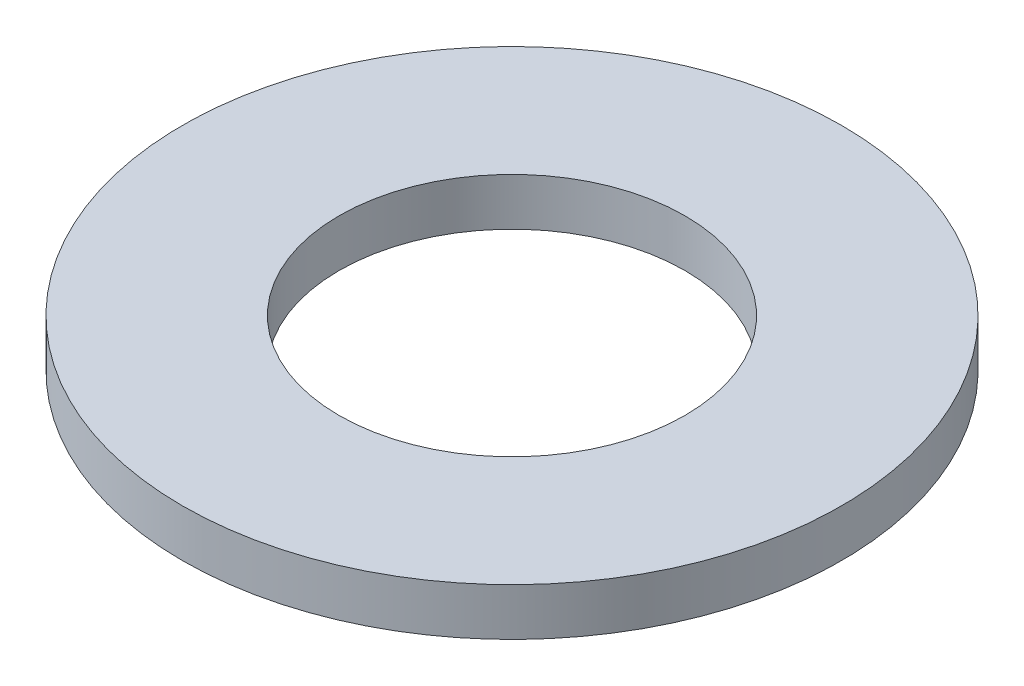
ISO-10303-21;
HEADER;
FILE_DESCRIPTION(('STEP AP214'),'2;1');
FILE_NAME('part.step','',(''),(''),'','','');
FILE_SCHEMA(('AUTOMOTIVE_DESIGN { 1 0 10303 214 1 1 1 1 }'));
ENDSEC;
DATA;
#1=APPLICATION_CONTEXT('core data for automotive mechanical design processes');
#2=APPLICATION_PROTOCOL_DEFINITION('international standard','automotive_design',2000,#1);
#3=PRODUCT_CONTEXT('',#1,'mechanical');
#4=PRODUCT('Part','Part','',(#3));
#5=PRODUCT_RELATED_PRODUCT_CATEGORY('part','',(#4));
#6=PRODUCT_DEFINITION_FORMATION('','',#4);
#7=PRODUCT_DEFINITION_CONTEXT('part definition',#1,'design');
#8=PRODUCT_DEFINITION('design','',#6,#7);
#9=PRODUCT_DEFINITION_SHAPE('','',#8);
#10=(LENGTH_UNIT() NAMED_UNIT(*) SI_UNIT(.MILLI.,.METRE.));
#11=(NAMED_UNIT(*) PLANE_ANGLE_UNIT() SI_UNIT($,.RADIAN.));
#12=(NAMED_UNIT(*) SI_UNIT($,.STERADIAN.) SOLID_ANGLE_UNIT());
#13=UNCERTAINTY_MEASURE_WITH_UNIT(LENGTH_MEASURE(1.E-05),#10,'distance_accuracy_value','');
#14=(GEOMETRIC_REPRESENTATION_CONTEXT(3) GLOBAL_UNCERTAINTY_ASSIGNED_CONTEXT((#13)) GLOBAL_UNIT_ASSIGNED_CONTEXT((#10,
#11,#12)) REPRESENTATION_CONTEXT('',''));
#15=CARTESIAN_POINT('',(0.,0.,0.));
#16=DIRECTION('',(0.,0.,1.));
#17=DIRECTION('',(1.,0.,0.));
#18=AXIS2_PLACEMENT_3D('',#15,#16,#17);
#19=CARTESIAN_POINT('',(0.,2.286,0.));
#20=DIRECTION('',(0.,1.,0.));
#21=DIRECTION('',(0.,0.,1.));
#22=AXIS2_PLACEMENT_3D('',#19,#20,#21);
#23=PLANE('',#22);
#24=CARTESIAN_POINT('',(0.,2.286,0.));
#25=DIRECTION('',(0.,1.,0.));
#26=DIRECTION('',(0.,0.,1.));
#27=AXIS2_PLACEMENT_3D('',#24,#25,#26);
#28=CIRCLE('',#27,8.3312);
#29=CARTESIAN_POINT('',(0.,2.286,8.3312));
#30=VERTEX_POINT('',#29);
#31=EDGE_CURVE('E28',#30,#30,#28,.F.);
#32=ORIENTED_EDGE('',*,*,#31,.T.);
#33=EDGE_LOOP('',(#32));
#34=FACE_BOUND('',#33,.T.);
#35=CARTESIAN_POINT('',(0.,2.286,0.));
#36=DIRECTION('',(0.,1.,0.));
#37=DIRECTION('',(0.,0.,1.));
#38=AXIS2_PLACEMENT_3D('',#35,#36,#37);
#39=CIRCLE('',#38,15.875);
#40=CARTESIAN_POINT('',(0.,2.286,15.875));
#41=VERTEX_POINT('',#40);
#42=EDGE_CURVE('E19',#41,#41,#39,.F.);
#43=ORIENTED_EDGE('',*,*,#42,.F.);
#44=EDGE_LOOP('',(#43));
#45=FACE_BOUND('',#44,.T.);
#46=ADVANCED_FACE('F16',(#34,#45),#23,.T.);
#47=CARTESIAN_POINT('',(0.,0.,0.));
#48=DIRECTION('',(0.,1.,0.));
#49=DIRECTION('',(0.,0.,1.));
#50=AXIS2_PLACEMENT_3D('',#47,#48,#49);
#51=CYLINDRICAL_SURFACE('',#50,15.875);
#52=ORIENTED_EDGE('',*,*,#42,.T.);
#53=EDGE_LOOP('',(#52));
#54=FACE_BOUND('',#53,.T.);
#55=CARTESIAN_POINT('',(0.,0.,0.));
#56=DIRECTION('',(0.,1.,0.));
#57=DIRECTION('',(0.,0.,1.));
#58=AXIS2_PLACEMENT_3D('',#55,#56,#57);
#59=CIRCLE('',#58,15.875);
#60=CARTESIAN_POINT('',(0.,0.,15.875));
#61=VERTEX_POINT('',#60);
#62=EDGE_CURVE('E23',#61,#61,#59,.T.);
#63=ORIENTED_EDGE('',*,*,#62,.T.);
#64=EDGE_LOOP('',(#63));
#65=FACE_BOUND('',#64,.T.);
#66=ADVANCED_FACE('F36',(#54,#65),#51,.T.);
#67=CARTESIAN_POINT('',(0.,0.,0.));
#68=DIRECTION('',(0.,1.,0.));
#69=DIRECTION('',(0.,0.,1.));
#70=AXIS2_PLACEMENT_3D('',#67,#68,#69);
#71=CYLINDRICAL_SURFACE('',#70,8.3312);
#72=ORIENTED_EDGE('',*,*,#31,.F.);
#73=EDGE_LOOP('',(#72));
#74=FACE_BOUND('',#73,.T.);
#75=CARTESIAN_POINT('',(0.,0.,0.));
#76=DIRECTION('',(0.,1.,0.));
#77=DIRECTION('',(0.,0.,1.));
#78=AXIS2_PLACEMENT_3D('',#75,#76,#77);
#79=CIRCLE('',#78,8.3312);
#80=CARTESIAN_POINT('',(0.,0.,8.3312));
#81=VERTEX_POINT('',#80);
#82=EDGE_CURVE('E11',#81,#81,#79,.F.);
#83=ORIENTED_EDGE('',*,*,#82,.T.);
#84=EDGE_LOOP('',(#83));
#85=FACE_BOUND('',#84,.T.);
#86=ADVANCED_FACE('F44',(#74,#85),#71,.F.);
#87=CARTESIAN_POINT('',(0.,0.,0.));
#88=DIRECTION('',(0.,1.,0.));
#89=DIRECTION('',(0.,0.,1.));
#90=AXIS2_PLACEMENT_3D('',#87,#88,#89);
#91=PLANE('',#90);
#92=ORIENTED_EDGE('',*,*,#82,.F.);
#93=EDGE_LOOP('',(#92));
#94=FACE_BOUND('',#93,.T.);
#95=ORIENTED_EDGE('',*,*,#62,.F.);
#96=EDGE_LOOP('',(#95));
#97=FACE_BOUND('',#96,.T.);
#98=ADVANCED_FACE('F45',(#94,#97),#91,.F.);
#99=CLOSED_SHELL('',(#46,#66,#86,#98));
#100=MANIFOLD_SOLID_BREP('B1',#99);
#101=ADVANCED_BREP_SHAPE_REPRESENTATION('',(#18,#100),#14);
#102=SHAPE_DEFINITION_REPRESENTATION(#9,#101);
ENDSEC;
END-ISO-10303-21;
